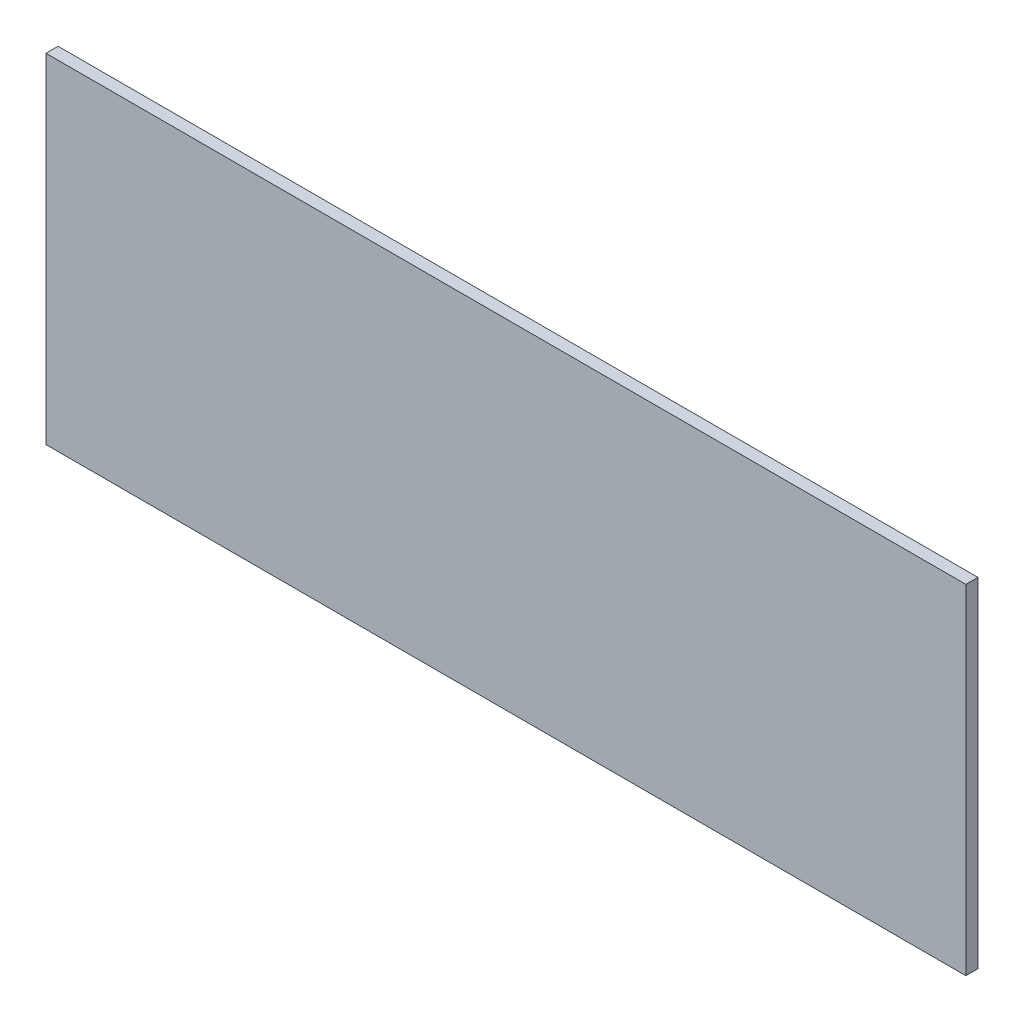
ISO-10303-21;
HEADER;
FILE_DESCRIPTION(('STEP AP214'),'2;1');
FILE_NAME('part.step','',(''),(''),'','','');
FILE_SCHEMA(('AUTOMOTIVE_DESIGN { 1 0 10303 214 1 1 1 1 }'));
ENDSEC;
DATA;
#1=APPLICATION_CONTEXT('core data for automotive mechanical design processes');
#2=APPLICATION_PROTOCOL_DEFINITION('international standard','automotive_design',2000,#1);
#3=PRODUCT_CONTEXT('',#1,'mechanical');
#4=PRODUCT('Part','Part','',(#3));
#5=PRODUCT_RELATED_PRODUCT_CATEGORY('part','',(#4));
#6=PRODUCT_DEFINITION_FORMATION('','',#4);
#7=PRODUCT_DEFINITION_CONTEXT('part definition',#1,'design');
#8=PRODUCT_DEFINITION('design','',#6,#7);
#9=PRODUCT_DEFINITION_SHAPE('','',#8);
#10=(LENGTH_UNIT() NAMED_UNIT(*) SI_UNIT(.MILLI.,.METRE.));
#11=(NAMED_UNIT(*) PLANE_ANGLE_UNIT() SI_UNIT($,.RADIAN.));
#12=(NAMED_UNIT(*) SI_UNIT($,.STERADIAN.) SOLID_ANGLE_UNIT());
#13=UNCERTAINTY_MEASURE_WITH_UNIT(LENGTH_MEASURE(1.E-05),#10,'distance_accuracy_value','');
#14=(GEOMETRIC_REPRESENTATION_CONTEXT(3) GLOBAL_UNCERTAINTY_ASSIGNED_CONTEXT((#13)) GLOBAL_UNIT_ASSIGNED_CONTEXT((#10,
#11,#12)) REPRESENTATION_CONTEXT('',''));
#15=CARTESIAN_POINT('',(0.,0.,0.));
#16=DIRECTION('',(0.,0.,1.));
#17=DIRECTION('',(1.,0.,0.));
#18=AXIS2_PLACEMENT_3D('',#15,#16,#17);
#19=CARTESIAN_POINT('',(0.,0.,6.35));
#20=DIRECTION('',(1.,0.,0.));
#21=DIRECTION('',(0.,0.,-1.));
#22=AXIS2_PLACEMENT_3D('',#19,#20,#21);
#23=PLANE('',#22);
#24=DIRECTION('',(0.,-1.,0.));
#25=VECTOR('',#24,1.);
#26=CARTESIAN_POINT('',(0.,0.,0.));
#27=LINE('',#26,#25);
#28=CARTESIAN_POINT('',(0.,177.8,0.));
#29=VERTEX_POINT('',#28);
#30=CARTESIAN_POINT('',(0.,0.,0.));
#31=VERTEX_POINT('',#30);
#32=EDGE_CURVE('E98',#29,#31,#27,.T.);
#33=ORIENTED_EDGE('',*,*,#32,.T.);
#34=DIRECTION('',(0.,0.,-1.));
#35=VECTOR('',#34,1.);
#36=CARTESIAN_POINT('',(0.,0.,6.35));
#37=LINE('',#36,#35);
#38=CARTESIAN_POINT('',(0.,0.,6.35));
#39=VERTEX_POINT('',#38);
#40=EDGE_CURVE('E11',#39,#31,#37,.T.);
#41=ORIENTED_EDGE('',*,*,#40,.F.);
#42=DIRECTION('',(0.,-1.,0.));
#43=VECTOR('',#42,1.);
#44=CARTESIAN_POINT('',(0.,0.,6.35));
#45=LINE('',#44,#43);
#46=CARTESIAN_POINT('',(0.,177.8,6.35));
#47=VERTEX_POINT('',#46);
#48=EDGE_CURVE('E86',#47,#39,#45,.T.);
#49=ORIENTED_EDGE('',*,*,#48,.F.);
#50=DIRECTION('',(0.,0.,-1.));
#51=VECTOR('',#50,1.);
#52=CARTESIAN_POINT('',(0.,177.8,6.35));
#53=LINE('',#52,#51);
#54=EDGE_CURVE('E94',#47,#29,#53,.T.);
#55=ORIENTED_EDGE('',*,*,#54,.T.);
#56=EDGE_LOOP('',(#33,#41,#49,#55));
#57=FACE_BOUND('',#56,.T.);
#58=ADVANCED_FACE('F35',(#57),#23,.F.);
#59=CARTESIAN_POINT('',(0.,0.,6.35));
#60=DIRECTION('',(0.,1.,0.));
#61=DIRECTION('',(0.,0.,1.));
#62=AXIS2_PLACEMENT_3D('',#59,#60,#61);
#63=PLANE('',#62);
#64=DIRECTION('',(1.,0.,0.));
#65=VECTOR('',#64,1.);
#66=CARTESIAN_POINT('',(0.,0.,0.));
#67=LINE('',#66,#65);
#68=CARTESIAN_POINT('',(482.6,0.,0.));
#69=VERTEX_POINT('',#68);
#70=EDGE_CURVE('E90',#31,#69,#67,.T.);
#71=ORIENTED_EDGE('',*,*,#70,.T.);
#72=DIRECTION('',(0.,0.,-1.));
#73=VECTOR('',#72,1.);
#74=CARTESIAN_POINT('',(482.6,0.,6.35));
#75=LINE('',#74,#73);
#76=CARTESIAN_POINT('',(482.6,0.,6.35));
#77=VERTEX_POINT('',#76);
#78=EDGE_CURVE('E43',#77,#69,#75,.T.);
#79=ORIENTED_EDGE('',*,*,#78,.F.);
#80=DIRECTION('',(1.,0.,0.));
#81=VECTOR('',#80,1.);
#82=CARTESIAN_POINT('',(0.,0.,6.35));
#83=LINE('',#82,#81);
#84=EDGE_CURVE('E81',#39,#77,#83,.T.);
#85=ORIENTED_EDGE('',*,*,#84,.F.);
#86=ORIENTED_EDGE('',*,*,#40,.T.);
#87=EDGE_LOOP('',(#71,#79,#85,#86));
#88=FACE_BOUND('',#87,.T.);
#89=ADVANCED_FACE('F89',(#88),#63,.F.);
#90=CARTESIAN_POINT('',(482.6,0.,6.35));
#91=DIRECTION('',(-1.,0.,0.));
#92=DIRECTION('',(0.,0.,1.));
#93=AXIS2_PLACEMENT_3D('',#90,#91,#92);
#94=PLANE('',#93);
#95=DIRECTION('',(0.,1.,0.));
#96=VECTOR('',#95,1.);
#97=CARTESIAN_POINT('',(482.6,0.,0.));
#98=LINE('',#97,#96);
#99=CARTESIAN_POINT('',(482.6,177.8,0.));
#100=VERTEX_POINT('',#99);
#101=EDGE_CURVE('E68',#69,#100,#98,.T.);
#102=ORIENTED_EDGE('',*,*,#101,.T.);
#103=DIRECTION('',(0.,0.,-1.));
#104=VECTOR('',#103,1.);
#105=CARTESIAN_POINT('',(482.6,177.8,6.35));
#106=LINE('',#105,#104);
#107=CARTESIAN_POINT('',(482.6,177.8,6.35));
#108=VERTEX_POINT('',#107);
#109=EDGE_CURVE('E91',#108,#100,#106,.T.);
#110=ORIENTED_EDGE('',*,*,#109,.F.);
#111=DIRECTION('',(0.,1.,0.));
#112=VECTOR('',#111,1.);
#113=CARTESIAN_POINT('',(482.6,0.,6.35));
#114=LINE('',#113,#112);
#115=EDGE_CURVE('E84',#77,#108,#114,.T.);
#116=ORIENTED_EDGE('',*,*,#115,.F.);
#117=ORIENTED_EDGE('',*,*,#78,.T.);
#118=EDGE_LOOP('',(#102,#110,#116,#117));
#119=FACE_BOUND('',#118,.T.);
#120=ADVANCED_FACE('F92',(#119),#94,.F.);
#121=CARTESIAN_POINT('',(0.,177.8,6.35));
#122=DIRECTION('',(0.,-1.,0.));
#123=DIRECTION('',(0.,0.,-1.));
#124=AXIS2_PLACEMENT_3D('',#121,#122,#123);
#125=PLANE('',#124);
#126=DIRECTION('',(-1.,0.,0.));
#127=VECTOR('',#126,1.);
#128=CARTESIAN_POINT('',(0.,177.8,0.));
#129=LINE('',#128,#127);
#130=EDGE_CURVE('E74',#100,#29,#129,.T.);
#131=ORIENTED_EDGE('',*,*,#130,.T.);
#132=ORIENTED_EDGE('',*,*,#54,.F.);
#133=DIRECTION('',(-1.,0.,0.));
#134=VECTOR('',#133,1.);
#135=CARTESIAN_POINT('',(0.,177.8,6.35));
#136=LINE('',#135,#134);
#137=EDGE_CURVE('E51',#108,#47,#136,.T.);
#138=ORIENTED_EDGE('',*,*,#137,.F.);
#139=ORIENTED_EDGE('',*,*,#109,.T.);
#140=EDGE_LOOP('',(#131,#132,#138,#139));
#141=FACE_BOUND('',#140,.T.);
#142=ADVANCED_FACE('F105',(#141),#125,.F.);
#143=CARTESIAN_POINT('',(0.,0.,6.35));
#144=DIRECTION('',(0.,0.,-1.));
#145=DIRECTION('',(-1.,0.,0.));
#146=AXIS2_PLACEMENT_3D('',#143,#144,#145);
#147=PLANE('',#146);
#148=ORIENTED_EDGE('',*,*,#48,.T.);
#149=ORIENTED_EDGE('',*,*,#84,.T.);
#150=ORIENTED_EDGE('',*,*,#115,.T.);
#151=ORIENTED_EDGE('',*,*,#137,.T.);
#152=EDGE_LOOP('',(#148,#149,#150,#151));
#153=FACE_BOUND('',#152,.T.);
#154=ADVANCED_FACE('F82',(#153),#147,.F.);
#155=CARTESIAN_POINT('',(0.,0.,0.));
#156=DIRECTION('',(0.,0.,-1.));
#157=DIRECTION('',(-1.,0.,0.));
#158=AXIS2_PLACEMENT_3D('',#155,#156,#157);
#159=PLANE('',#158);
#160=ORIENTED_EDGE('',*,*,#32,.F.);
#161=ORIENTED_EDGE('',*,*,#130,.F.);
#162=ORIENTED_EDGE('',*,*,#101,.F.);
#163=ORIENTED_EDGE('',*,*,#70,.F.);
#164=EDGE_LOOP('',(#160,#161,#162,#163));
#165=FACE_BOUND('',#164,.T.);
#166=ADVANCED_FACE('F108',(#165),#159,.T.);
#167=CLOSED_SHELL('',(#58,#89,#120,#142,#154,#166));
#168=MANIFOLD_SOLID_BREP('B2',#167);
#169=ADVANCED_BREP_SHAPE_REPRESENTATION('',(#18,#168),#14);
#170=SHAPE_DEFINITION_REPRESENTATION(#9,#169);
ENDSEC;
END-ISO-10303-21;
